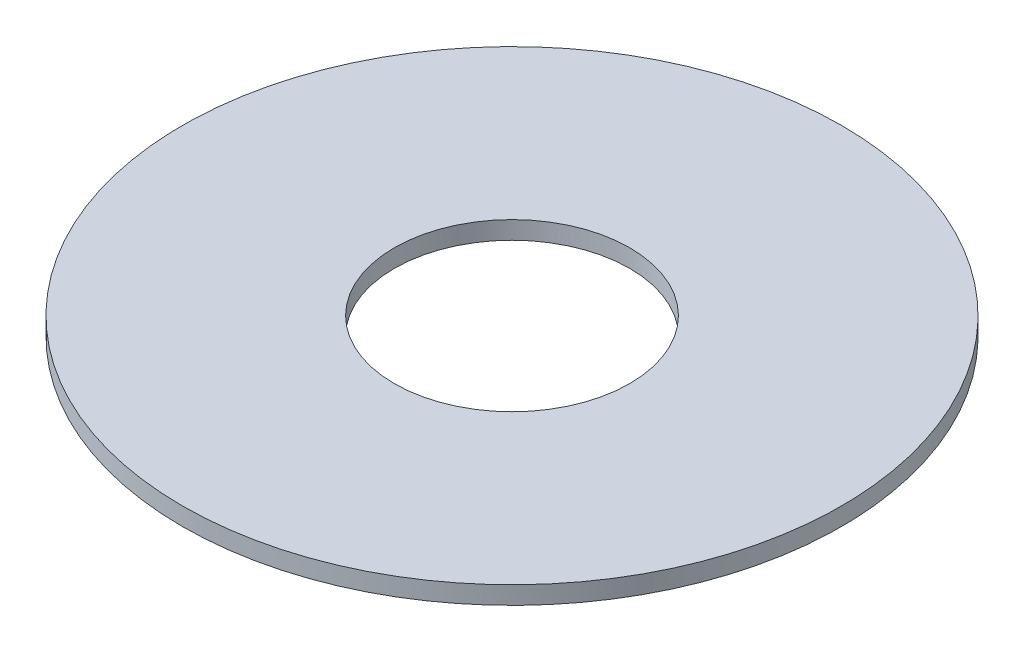
ISO-10303-21;
HEADER;
FILE_DESCRIPTION(('STEP AP214'),'2;1');
FILE_NAME('part.step','',(''),(''),'','','');
FILE_SCHEMA(('AUTOMOTIVE_DESIGN { 1 0 10303 214 1 1 1 1 }'));
ENDSEC;
DATA;
#1=APPLICATION_CONTEXT('core data for automotive mechanical design processes');
#2=APPLICATION_PROTOCOL_DEFINITION('international standard','automotive_design',2000,#1);
#3=PRODUCT_CONTEXT('',#1,'mechanical');
#4=PRODUCT('Part','Part','',(#3));
#5=PRODUCT_RELATED_PRODUCT_CATEGORY('part','',(#4));
#6=PRODUCT_DEFINITION_FORMATION('','',#4);
#7=PRODUCT_DEFINITION_CONTEXT('part definition',#1,'design');
#8=PRODUCT_DEFINITION('design','',#6,#7);
#9=PRODUCT_DEFINITION_SHAPE('','',#8);
#10=(LENGTH_UNIT() NAMED_UNIT(*) SI_UNIT(.MILLI.,.METRE.));
#11=(NAMED_UNIT(*) PLANE_ANGLE_UNIT() SI_UNIT($,.RADIAN.));
#12=(NAMED_UNIT(*) SI_UNIT($,.STERADIAN.) SOLID_ANGLE_UNIT());
#13=UNCERTAINTY_MEASURE_WITH_UNIT(LENGTH_MEASURE(1.E-05),#10,'distance_accuracy_value','');
#14=(GEOMETRIC_REPRESENTATION_CONTEXT(3) GLOBAL_UNCERTAINTY_ASSIGNED_CONTEXT((#13)) GLOBAL_UNIT_ASSIGNED_CONTEXT((#10,
#11,#12)) REPRESENTATION_CONTEXT('',''));
#15=CARTESIAN_POINT('',(0.,0.,0.));
#16=DIRECTION('',(0.,0.,1.));
#17=DIRECTION('',(1.,0.,0.));
#18=AXIS2_PLACEMENT_3D('',#15,#16,#17);
#19=CARTESIAN_POINT('',(0.,1.9,0.));
#20=DIRECTION('',(0.,1.,0.));
#21=DIRECTION('',(0.,0.,1.));
#22=AXIS2_PLACEMENT_3D('',#19,#20,#21);
#23=PLANE('',#22);
#24=CARTESIAN_POINT('',(0.,1.9,0.));
#25=DIRECTION('',(0.,1.,0.));
#26=DIRECTION('',(0.,0.,1.));
#27=AXIS2_PLACEMENT_3D('',#24,#25,#26);
#28=CIRCLE('',#27,35.);
#29=CARTESIAN_POINT('',(0.,1.9,35.));
#30=VERTEX_POINT('',#29);
#31=EDGE_CURVE('E10',#30,#30,#28,.T.);
#32=ORIENTED_EDGE('',*,*,#31,.T.);
#33=EDGE_LOOP('',(#32));
#34=FACE_BOUND('',#33,.T.);
#35=CARTESIAN_POINT('',(0.,1.9,0.));
#36=DIRECTION('',(0.,1.,0.));
#37=DIRECTION('',(0.,0.,1.));
#38=AXIS2_PLACEMENT_3D('',#35,#36,#37);
#39=CIRCLE('',#38,12.5);
#40=CARTESIAN_POINT('',(0.,1.9,12.5));
#41=VERTEX_POINT('',#40);
#42=EDGE_CURVE('E56',#41,#41,#39,.T.);
#43=ORIENTED_EDGE('',*,*,#42,.F.);
#44=EDGE_LOOP('',(#43));
#45=FACE_BOUND('',#44,.T.);
#46=ADVANCED_FACE('F45',(#34,#45),#23,.T.);
#47=CARTESIAN_POINT('',(0.,0.,0.));
#48=DIRECTION('',(0.,1.,0.));
#49=DIRECTION('',(0.,0.,1.));
#50=AXIS2_PLACEMENT_3D('',#47,#48,#49);
#51=PLANE('',#50);
#52=CARTESIAN_POINT('',(0.,0.,0.));
#53=DIRECTION('',(0.,1.,0.));
#54=DIRECTION('',(0.,0.,1.));
#55=AXIS2_PLACEMENT_3D('',#52,#53,#54);
#56=CIRCLE('',#55,35.);
#57=CARTESIAN_POINT('',(0.,0.,35.));
#58=VERTEX_POINT('',#57);
#59=EDGE_CURVE('E49',#58,#58,#56,.T.);
#60=ORIENTED_EDGE('',*,*,#59,.F.);
#61=EDGE_LOOP('',(#60));
#62=FACE_BOUND('',#61,.T.);
#63=CARTESIAN_POINT('',(0.,0.,0.));
#64=DIRECTION('',(0.,1.,0.));
#65=DIRECTION('',(0.,0.,1.));
#66=AXIS2_PLACEMENT_3D('',#63,#64,#65);
#67=CIRCLE('',#66,12.5);
#68=CARTESIAN_POINT('',(0.,0.,12.5));
#69=VERTEX_POINT('',#68);
#70=EDGE_CURVE('E58',#69,#69,#67,.T.);
#71=ORIENTED_EDGE('',*,*,#70,.T.);
#72=EDGE_LOOP('',(#71));
#73=FACE_BOUND('',#72,.T.);
#74=ADVANCED_FACE('F68',(#62,#73),#51,.F.);
#75=CARTESIAN_POINT('',(0.,1.9,0.));
#76=DIRECTION('',(0.,-1.,0.));
#77=DIRECTION('',(0.,0.,-1.));
#78=AXIS2_PLACEMENT_3D('',#75,#76,#77);
#79=CYLINDRICAL_SURFACE('',#78,35.);
#80=ORIENTED_EDGE('',*,*,#31,.F.);
#81=EDGE_LOOP('',(#80));
#82=FACE_BOUND('',#81,.T.);
#83=ORIENTED_EDGE('',*,*,#59,.T.);
#84=EDGE_LOOP('',(#83));
#85=FACE_BOUND('',#84,.T.);
#86=ADVANCED_FACE('F47',(#82,#85),#79,.T.);
#87=CARTESIAN_POINT('',(0.,1.9,0.));
#88=DIRECTION('',(0.,-1.,0.));
#89=DIRECTION('',(0.,0.,-1.));
#90=AXIS2_PLACEMENT_3D('',#87,#88,#89);
#91=CYLINDRICAL_SURFACE('',#90,12.5);
#92=ORIENTED_EDGE('',*,*,#42,.T.);
#93=EDGE_LOOP('',(#92));
#94=FACE_BOUND('',#93,.T.);
#95=ORIENTED_EDGE('',*,*,#70,.F.);
#96=EDGE_LOOP('',(#95));
#97=FACE_BOUND('',#96,.T.);
#98=ADVANCED_FACE('F64',(#94,#97),#91,.F.);
#99=CLOSED_SHELL('',(#46,#74,#86,#98));
#100=MANIFOLD_SOLID_BREP('B2',#99);
#101=ADVANCED_BREP_SHAPE_REPRESENTATION('',(#18,#100),#14);
#102=SHAPE_DEFINITION_REPRESENTATION(#9,#101);
ENDSEC;
END-ISO-10303-21;
